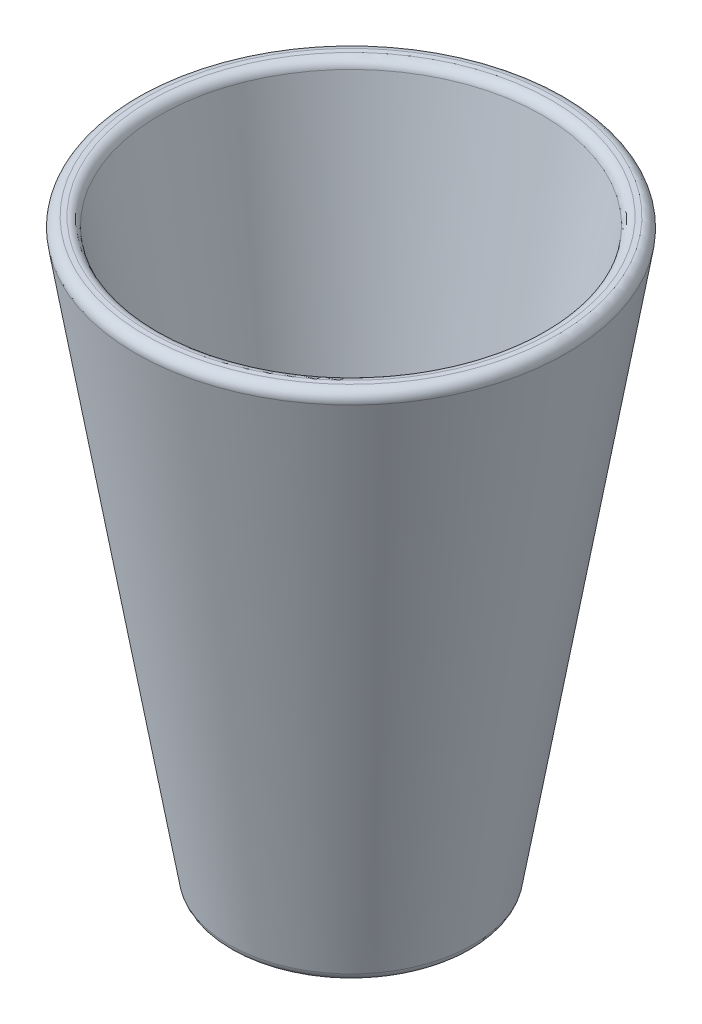
ISO-10303-21;
HEADER;
FILE_DESCRIPTION(('STEP AP214'),'2;1');
FILE_NAME('part.step','',(''),(''),'','','');
FILE_SCHEMA(('AUTOMOTIVE_DESIGN { 1 0 10303 214 1 1 1 1 }'));
ENDSEC;
DATA;
#1=APPLICATION_CONTEXT('core data for automotive mechanical design processes');
#2=APPLICATION_PROTOCOL_DEFINITION('international standard','automotive_design',2000,#1);
#3=PRODUCT_CONTEXT('',#1,'mechanical');
#4=PRODUCT('Part','Part','',(#3));
#5=PRODUCT_RELATED_PRODUCT_CATEGORY('part','',(#4));
#6=PRODUCT_DEFINITION_FORMATION('','',#4);
#7=PRODUCT_DEFINITION_CONTEXT('part definition',#1,'design');
#8=PRODUCT_DEFINITION('design','',#6,#7);
#9=PRODUCT_DEFINITION_SHAPE('','',#8);
#10=(LENGTH_UNIT() NAMED_UNIT(*) SI_UNIT(.MILLI.,.METRE.));
#11=(NAMED_UNIT(*) PLANE_ANGLE_UNIT() SI_UNIT($,.RADIAN.));
#12=(NAMED_UNIT(*) SI_UNIT($,.STERADIAN.) SOLID_ANGLE_UNIT());
#13=UNCERTAINTY_MEASURE_WITH_UNIT(LENGTH_MEASURE(1.E-05),#10,'distance_accuracy_value','');
#14=(GEOMETRIC_REPRESENTATION_CONTEXT(3) GLOBAL_UNCERTAINTY_ASSIGNED_CONTEXT((#13)) GLOBAL_UNIT_ASSIGNED_CONTEXT((#10,
#11,#12)) REPRESENTATION_CONTEXT('',''));
#15=CARTESIAN_POINT('',(0.,0.,0.));
#16=DIRECTION('',(0.,0.,1.));
#17=DIRECTION('',(1.,0.,0.));
#18=AXIS2_PLACEMENT_3D('',#15,#16,#17);
#19=CARTESIAN_POINT('',(250.,-623.807622343493,0.));
#20=DIRECTION('',(0.,1.,0.));
#21=DIRECTION('',(0.,0.,1.));
#22=AXIS2_PLACEMENT_3D('',#19,#20,#21);
#23=PLANE('',#22);
#24=CARTESIAN_POINT('',(0.,-623.807622343493,0.));
#25=DIRECTION('',(0.,1.,0.));
#26=DIRECTION('',(0.,0.,1.));
#27=AXIS2_PLACEMENT_3D('',#24,#25,#26);
#28=CIRCLE('',#27,233.067126442249);
#29=CARTESIAN_POINT('',(0.,-623.807622343493,233.067126442249));
#30=VERTEX_POINT('',#29);
#31=EDGE_CURVE('E45',#30,#30,#28,.F.);
#32=ORIENTED_EDGE('',*,*,#31,.T.);
#33=EDGE_LOOP('',(#32));
#34=FACE_BOUND('',#33,.T.);
#35=ADVANCED_FACE('F37',(#34),#23,.F.);
#36=CARTESIAN_POINT('',(0.,-623.807622343493,0.));
#37=DIRECTION('',(0.,1.,0.));
#38=DIRECTION('',(0.,0.,1.));
#39=AXIS2_PLACEMENT_3D('',#36,#37,#38);
#40=CONICAL_SURFACE('',#39,250.,0.165711694323707);
#41=CARTESIAN_POINT('',(0.,552.893291302949,0.));
#42=DIRECTION('',(0.,-1.,0.));
#43=DIRECTION('',(0.,0.,-1.));
#44=AXIS2_PLACEMENT_3D('',#41,#42,#43);
#45=CIRCLE('',#44,446.797788271418);
#46=CARTESIAN_POINT('',(0.,552.893291302949,-446.797788271418));
#47=VERTEX_POINT('',#46);
#48=EDGE_CURVE('E50',#47,#47,#45,.T.);
#49=ORIENTED_EDGE('',*,*,#48,.T.);
#50=EDGE_LOOP('',(#49));
#51=FACE_BOUND('',#50,.T.);
#52=CARTESIAN_POINT('',(0.,-607.106708697051,0.));
#53=DIRECTION('',(0.,-1.,0.));
#54=DIRECTION('',(0.,0.,-1.));
#55=AXIS2_PLACEMENT_3D('',#52,#53,#54);
#56=CIRCLE('',#55,252.793150604045);
#57=CARTESIAN_POINT('',(0.,-607.106708697051,-252.793150604045));
#58=VERTEX_POINT('',#57);
#59=EDGE_CURVE('E55',#58,#58,#56,.F.);
#60=ORIENTED_EDGE('',*,*,#59,.T.);
#61=EDGE_LOOP('',(#60));
#62=FACE_BOUND('',#61,.T.);
#63=ADVANCED_FACE('F86',(#51,#62),#40,.T.);
#64=CARTESIAN_POINT('',(400.,576.192377656507,0.));
#65=DIRECTION('',(0.,-1.,0.));
#66=DIRECTION('',(0.,0.,-1.));
#67=AXIS2_PLACEMENT_3D('',#64,#65,#66);
#68=PLANE('',#67);
#69=CARTESIAN_POINT('',(0.,576.192377656507,0.));
#70=DIRECTION('',(0.,-1.,0.));
#71=DIRECTION('',(0.,0.,-1.));
#72=AXIS2_PLACEMENT_3D('',#69,#70,#71);
#73=CIRCLE('',#72,427.071764109622);
#74=CARTESIAN_POINT('',(0.,576.192377656507,-427.071764109622));
#75=VERTEX_POINT('',#74);
#76=EDGE_CURVE('E61',#75,#75,#73,.F.);
#77=ORIENTED_EDGE('',*,*,#76,.T.);
#78=EDGE_LOOP('',(#77));
#79=FACE_BOUND('',#78,.T.);
#80=CARTESIAN_POINT('',(0.,576.192377656507,0.));
#81=DIRECTION('',(0.,-1.,0.));
#82=DIRECTION('',(0.,0.,-1.));
#83=AXIS2_PLACEMENT_3D('',#80,#81,#82);
#84=CIRCLE('',#83,416.932873557751);
#85=CARTESIAN_POINT('',(0.,576.192377656507,-416.932873557751));
#86=VERTEX_POINT('',#85);
#87=EDGE_CURVE('E65',#86,#86,#84,.T.);
#88=ORIENTED_EDGE('',*,*,#87,.T.);
#89=EDGE_LOOP('',(#88));
#90=FACE_BOUND('',#89,.T.);
#91=ADVANCED_FACE('F78',(#79,#90),#68,.F.);
#92=CARTESIAN_POINT('',(0.,576.192377656507,0.));
#93=DIRECTION('',(0.,1.,0.));
#94=DIRECTION('',(0.,0.,1.));
#95=AXIS2_PLACEMENT_3D('',#92,#93,#94);
#96=CONICAL_SURFACE('',#95,400.,0.165711694323707);
#97=CARTESIAN_POINT('',(0.,559.491464010065,0.));
#98=DIRECTION('',(0.,-1.,0.));
#99=DIRECTION('',(0.,0.,-1.));
#100=AXIS2_PLACEMENT_3D('',#97,#98,#99);
#101=CIRCLE('',#100,397.206849395955);
#102=CARTESIAN_POINT('',(0.,559.491464010065,-397.206849395955));
#103=VERTEX_POINT('',#102);
#104=EDGE_CURVE('E10',#103,#103,#101,.F.);
#105=ORIENTED_EDGE('',*,*,#104,.T.);
#106=EDGE_LOOP('',(#105));
#107=FACE_BOUND('',#106,.T.);
#108=CARTESIAN_POINT('',(0.,-573.807622343493,0.));
#109=DIRECTION('',(0.,1.,0.));
#110=DIRECTION('',(0.,0.,1.));
#111=AXIS2_PLACEMENT_3D('',#108,#109,#110);
#112=CIRCLE('',#111,207.667816105622);
#113=CARTESIAN_POINT('',(0.,-573.807622343493,207.667816105622));
#114=VERTEX_POINT('',#113);
#115=EDGE_CURVE('E69',#114,#114,#112,.T.);
#116=ORIENTED_EDGE('',*,*,#115,.F.);
#117=EDGE_LOOP('',(#116));
#118=FACE_BOUND('',#117,.T.);
#119=ADVANCED_FACE('F76',(#107,#118),#96,.F.);
#120=CARTESIAN_POINT('',(1.20710625630972E-13,-573.807622343493,0.));
#121=DIRECTION('',(0.,-1.,0.));
#122=DIRECTION('',(0.,0.,-1.));
#123=AXIS2_PLACEMENT_3D('',#120,#121,#122);
#124=PLANE('',#123);
#125=ORIENTED_EDGE('',*,*,#115,.T.);
#126=EDGE_LOOP('',(#125));
#127=FACE_BOUND('',#126,.T.);
#128=ADVANCED_FACE('F74',(#127),#124,.F.);
#129=CARTESIAN_POINT('',(0.,556.192377656507,0.));
#130=DIRECTION('',(0.,-1.,0.));
#131=DIRECTION('',(0.,0.,-1.));
#132=AXIS2_PLACEMENT_3D('',#129,#130,#131);
#133=TOROIDAL_SURFACE('',#132,427.071764109622,20.);
#134=ORIENTED_EDGE('',*,*,#48,.F.);
#135=EDGE_LOOP('',(#134));
#136=FACE_BOUND('',#135,.T.);
#137=ORIENTED_EDGE('',*,*,#76,.F.);
#138=EDGE_LOOP('',(#137));
#139=FACE_BOUND('',#138,.T.);
#140=ADVANCED_FACE('F84',(#136,#139),#133,.T.);
#141=CARTESIAN_POINT('',(0.,-603.807622343493,0.));
#142=DIRECTION('',(0.,1.,0.));
#143=DIRECTION('',(0.,0.,1.));
#144=AXIS2_PLACEMENT_3D('',#141,#142,#143);
#145=TOROIDAL_SURFACE('',#144,233.067126442249,20.);
#146=ORIENTED_EDGE('',*,*,#31,.F.);
#147=EDGE_LOOP('',(#146));
#148=FACE_BOUND('',#147,.T.);
#149=ORIENTED_EDGE('',*,*,#59,.F.);
#150=EDGE_LOOP('',(#149));
#151=FACE_BOUND('',#150,.T.);
#152=ADVANCED_FACE('F98',(#148,#151),#145,.T.);
#153=CARTESIAN_POINT('',(0.,556.192377656507,0.));
#154=DIRECTION('',(0.,-1.,0.));
#155=DIRECTION('',(0.,0.,-1.));
#156=AXIS2_PLACEMENT_3D('',#153,#154,#155);
#157=TOROIDAL_SURFACE('',#156,416.932873557751,20.);
#158=ORIENTED_EDGE('',*,*,#87,.F.);
#159=EDGE_LOOP('',(#158));
#160=FACE_BOUND('',#159,.T.);
#161=ORIENTED_EDGE('',*,*,#104,.F.);
#162=EDGE_LOOP('',(#161));
#163=FACE_BOUND('',#162,.T.);
#164=ADVANCED_FACE('F39',(#160,#163),#157,.T.);
#165=CLOSED_SHELL('',(#35,#63,#91,#119,#128,#140,#152,#164));
#166=MANIFOLD_SOLID_BREP('B2',#165);
#167=ADVANCED_BREP_SHAPE_REPRESENTATION('',(#18,#166),#14);
#168=SHAPE_DEFINITION_REPRESENTATION(#9,#167);
ENDSEC;
END-ISO-10303-21;
